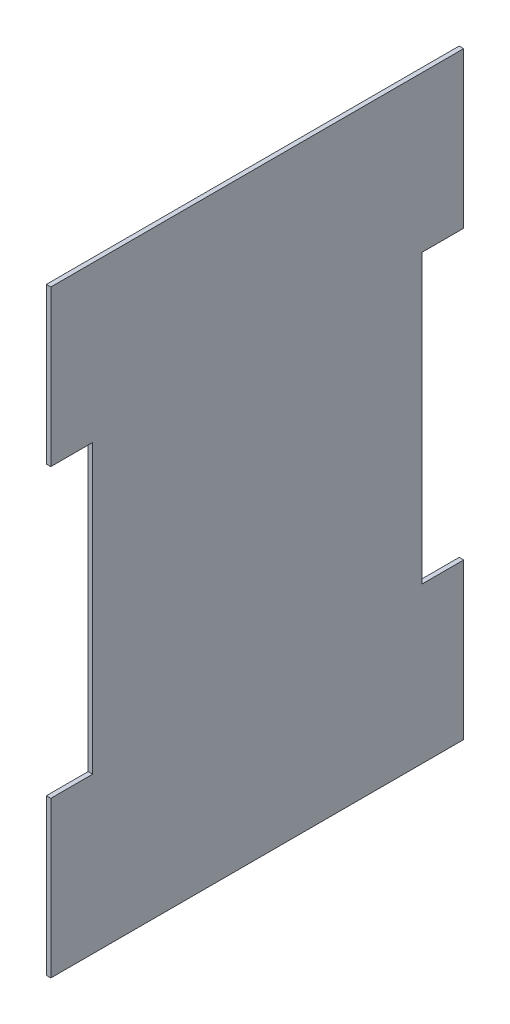
ISO-10303-21;
HEADER;
FILE_DESCRIPTION(('STEP AP214'),'2;1');
FILE_NAME('part.step','',(''),(''),'','','');
FILE_SCHEMA(('AUTOMOTIVE_DESIGN { 1 0 10303 214 1 1 1 1 }'));
ENDSEC;
DATA;
#1=APPLICATION_CONTEXT('core data for automotive mechanical design processes');
#2=APPLICATION_PROTOCOL_DEFINITION('international standard','automotive_design',2000,#1);
#3=PRODUCT_CONTEXT('',#1,'mechanical');
#4=PRODUCT('Part','Part','',(#3));
#5=PRODUCT_RELATED_PRODUCT_CATEGORY('part','',(#4));
#6=PRODUCT_DEFINITION_FORMATION('','',#4);
#7=PRODUCT_DEFINITION_CONTEXT('part definition',#1,'design');
#8=PRODUCT_DEFINITION('design','',#6,#7);
#9=PRODUCT_DEFINITION_SHAPE('','',#8);
#10=(LENGTH_UNIT() NAMED_UNIT(*) SI_UNIT(.MILLI.,.METRE.));
#11=(NAMED_UNIT(*) PLANE_ANGLE_UNIT() SI_UNIT($,.RADIAN.));
#12=(NAMED_UNIT(*) SI_UNIT($,.STERADIAN.) SOLID_ANGLE_UNIT());
#13=UNCERTAINTY_MEASURE_WITH_UNIT(LENGTH_MEASURE(1.E-05),#10,'distance_accuracy_value','');
#14=(GEOMETRIC_REPRESENTATION_CONTEXT(3) GLOBAL_UNCERTAINTY_ASSIGNED_CONTEXT((#13)) GLOBAL_UNIT_ASSIGNED_CONTEXT((#10,
#11,#12)) REPRESENTATION_CONTEXT('',''));
#15=CARTESIAN_POINT('',(0.,0.,0.));
#16=DIRECTION('',(0.,0.,1.));
#17=DIRECTION('',(1.,0.,0.));
#18=AXIS2_PLACEMENT_3D('',#15,#16,#17);
#19=CARTESIAN_POINT('',(3.,190.538461538462,261.692307692308));
#20=DIRECTION('',(0.,0.,-1.));
#21=DIRECTION('',(0.,1.,0.));
#22=AXIS2_PLACEMENT_3D('',#19,#20,#21);
#23=PLANE('',#22);
#24=DIRECTION('',(-1.,0.,0.));
#25=VECTOR('',#24,1.);
#26=CARTESIAN_POINT('',(25.,-105.461538461538,261.692307692308));
#27=LINE('',#26,#25);
#28=CARTESIAN_POINT('',(3.,-105.461538461538,261.692307692308));
#29=VERTEX_POINT('',#28);
#30=CARTESIAN_POINT('',(0.,-105.461538461538,261.692307692308));
#31=VERTEX_POINT('',#30);
#32=EDGE_CURVE('E132',#29,#31,#27,.T.);
#33=ORIENTED_EDGE('',*,*,#32,.T.);
#34=DIRECTION('',(0.,-1.,0.));
#35=VECTOR('',#34,1.);
#36=CARTESIAN_POINT('',(0.,190.538461538462,261.692307692308));
#37=LINE('',#36,#35);
#38=CARTESIAN_POINT('',(0.,-209.461538461539,261.692307692308));
#39=VERTEX_POINT('',#38);
#40=EDGE_CURVE('E147',#31,#39,#37,.T.);
#41=ORIENTED_EDGE('',*,*,#40,.T.);
#42=DIRECTION('',(-1.,0.,0.));
#43=VECTOR('',#42,1.);
#44=CARTESIAN_POINT('',(3.,-209.461538461539,261.692307692308));
#45=LINE('',#44,#43);
#46=CARTESIAN_POINT('',(3.,-209.461538461539,261.692307692308));
#47=VERTEX_POINT('',#46);
#48=EDGE_CURVE('E11',#47,#39,#45,.T.);
#49=ORIENTED_EDGE('',*,*,#48,.F.);
#50=DIRECTION('',(0.,-1.,0.));
#51=VECTOR('',#50,1.);
#52=CARTESIAN_POINT('',(3.,190.538461538462,261.692307692308));
#53=LINE('',#52,#51);
#54=EDGE_CURVE('E149',#29,#47,#53,.T.);
#55=ORIENTED_EDGE('',*,*,#54,.F.);
#56=EDGE_LOOP('',(#33,#41,#49,#55));
#57=FACE_BOUND('',#56,.T.);
#58=ADVANCED_FACE('F39',(#57),#23,.F.);
#59=DIRECTION('',(-1.,0.,0.));
#60=VECTOR('',#59,1.);
#61=CARTESIAN_POINT('',(25.,86.5384615384615,261.692307692308));
#62=LINE('',#61,#60);
#63=CARTESIAN_POINT('',(3.,86.5384615384615,261.692307692308));
#64=VERTEX_POINT('',#63);
#65=CARTESIAN_POINT('',(0.,86.5384615384615,261.692307692308));
#66=VERTEX_POINT('',#65);
#67=EDGE_CURVE('E62',#64,#66,#62,.T.);
#68=ORIENTED_EDGE('',*,*,#67,.F.);
#69=CARTESIAN_POINT('',(3.,190.538461538462,261.692307692308));
#70=VERTEX_POINT('',#69);
#71=EDGE_CURVE('E238',#70,#64,#53,.T.);
#72=ORIENTED_EDGE('',*,*,#71,.F.);
#73=DIRECTION('',(-1.,0.,0.));
#74=VECTOR('',#73,1.);
#75=CARTESIAN_POINT('',(3.,190.538461538462,261.692307692308));
#76=LINE('',#75,#74);
#77=CARTESIAN_POINT('',(0.,190.538461538462,261.692307692308));
#78=VERTEX_POINT('',#77);
#79=EDGE_CURVE('E179',#70,#78,#76,.T.);
#80=ORIENTED_EDGE('',*,*,#79,.T.);
#81=EDGE_CURVE('E157',#78,#66,#37,.T.);
#82=ORIENTED_EDGE('',*,*,#81,.T.);
#83=EDGE_LOOP('',(#68,#72,#80,#82));
#84=FACE_BOUND('',#83,.T.);
#85=ADVANCED_FACE('F263',(#84),#23,.F.);
#86=CARTESIAN_POINT('',(3.,190.538461538462,-14.3076923076922));
#87=DIRECTION('',(0.,0.,1.));
#88=DIRECTION('',(0.,-1.,0.));
#89=AXIS2_PLACEMENT_3D('',#86,#87,#88);
#90=PLANE('',#89);
#91=DIRECTION('',(-1.,0.,0.));
#92=VECTOR('',#91,1.);
#93=CARTESIAN_POINT('',(25.,86.5384615384615,-14.3076923076921));
#94=LINE('',#93,#92);
#95=CARTESIAN_POINT('',(3.,86.5384615384615,-14.3076923076921));
#96=VERTEX_POINT('',#95);
#97=CARTESIAN_POINT('',(0.,86.5384615384615,-14.3076923076921));
#98=VERTEX_POINT('',#97);
#99=EDGE_CURVE('E142',#96,#98,#94,.T.);
#100=ORIENTED_EDGE('',*,*,#99,.T.);
#101=DIRECTION('',(0.,1.,0.));
#102=VECTOR('',#101,1.);
#103=CARTESIAN_POINT('',(0.,190.538461538462,-14.3076923076922));
#104=LINE('',#103,#102);
#105=CARTESIAN_POINT('',(0.,190.538461538462,-14.3076923076922));
#106=VERTEX_POINT('',#105);
#107=EDGE_CURVE('E171',#98,#106,#104,.T.);
#108=ORIENTED_EDGE('',*,*,#107,.T.);
#109=DIRECTION('',(-1.,0.,0.));
#110=VECTOR('',#109,1.);
#111=CARTESIAN_POINT('',(3.,190.538461538462,-14.3076923076922));
#112=LINE('',#111,#110);
#113=CARTESIAN_POINT('',(3.,190.538461538462,-14.3076923076922));
#114=VERTEX_POINT('',#113);
#115=EDGE_CURVE('E183',#114,#106,#112,.T.);
#116=ORIENTED_EDGE('',*,*,#115,.F.);
#117=DIRECTION('',(0.,1.,0.));
#118=VECTOR('',#117,1.);
#119=CARTESIAN_POINT('',(3.,190.538461538462,-14.3076923076922));
#120=LINE('',#119,#118);
#121=EDGE_CURVE('E244',#96,#114,#120,.T.);
#122=ORIENTED_EDGE('',*,*,#121,.F.);
#123=EDGE_LOOP('',(#100,#108,#116,#122));
#124=FACE_BOUND('',#123,.T.);
#125=ADVANCED_FACE('F255',(#124),#90,.F.);
#126=DIRECTION('',(-1.,0.,0.));
#127=VECTOR('',#126,1.);
#128=CARTESIAN_POINT('',(25.,-105.461538461538,-14.3076923076922));
#129=LINE('',#128,#127);
#130=CARTESIAN_POINT('',(3.,-105.461538461538,-14.3076923076922));
#131=VERTEX_POINT('',#130);
#132=CARTESIAN_POINT('',(0.,-105.461538461538,-14.3076923076923));
#133=VERTEX_POINT('',#132);
#134=EDGE_CURVE('E54',#131,#133,#129,.T.);
#135=ORIENTED_EDGE('',*,*,#134,.F.);
#136=CARTESIAN_POINT('',(3.,-209.461538461539,-14.3076923076923));
#137=VERTEX_POINT('',#136);
#138=EDGE_CURVE('E193',#137,#131,#120,.T.);
#139=ORIENTED_EDGE('',*,*,#138,.F.);
#140=DIRECTION('',(-1.,0.,0.));
#141=VECTOR('',#140,1.);
#142=CARTESIAN_POINT('',(3.,-209.461538461539,-14.3076923076923));
#143=LINE('',#142,#141);
#144=CARTESIAN_POINT('',(0.,-209.461538461539,-14.3076923076923));
#145=VERTEX_POINT('',#144);
#146=EDGE_CURVE('E47',#137,#145,#143,.T.);
#147=ORIENTED_EDGE('',*,*,#146,.T.);
#148=EDGE_CURVE('E172',#145,#133,#104,.T.);
#149=ORIENTED_EDGE('',*,*,#148,.T.);
#150=EDGE_LOOP('',(#135,#139,#147,#149));
#151=FACE_BOUND('',#150,.T.);
#152=ADVANCED_FACE('F191',(#151),#90,.F.);
#153=CARTESIAN_POINT('',(3.,0.,0.));
#154=DIRECTION('',(1.,0.,0.));
#155=DIRECTION('',(0.,0.,-1.));
#156=AXIS2_PLACEMENT_3D('',#153,#154,#155);
#157=PLANE('',#156);
#158=DIRECTION('',(0.,-1.,0.));
#159=VECTOR('',#158,1.);
#160=CARTESIAN_POINT('',(3.,0.,233.692307692308));
#161=LINE('',#160,#159);
#162=CARTESIAN_POINT('',(3.,86.5384615384615,233.692307692308));
#163=VERTEX_POINT('',#162);
#164=CARTESIAN_POINT('',(3.,-105.461538461538,233.692307692308));
#165=VERTEX_POINT('',#164);
#166=EDGE_CURVE('E163',#163,#165,#161,.T.);
#167=ORIENTED_EDGE('',*,*,#166,.T.);
#168=DIRECTION('',(0.,0.,1.));
#169=VECTOR('',#168,1.);
#170=CARTESIAN_POINT('',(3.,-105.461538461538,0.));
#171=LINE('',#170,#169);
#172=EDGE_CURVE('E158',#165,#29,#171,.T.);
#173=ORIENTED_EDGE('',*,*,#172,.T.);
#174=ORIENTED_EDGE('',*,*,#54,.T.);
#175=DIRECTION('',(0.,0.,-1.));
#176=VECTOR('',#175,1.);
#177=CARTESIAN_POINT('',(3.,-209.461538461539,261.692307692308));
#178=LINE('',#177,#176);
#179=EDGE_CURVE('E242',#47,#137,#178,.T.);
#180=ORIENTED_EDGE('',*,*,#179,.T.);
#181=ORIENTED_EDGE('',*,*,#138,.T.);
#182=DIRECTION('',(0.,0.,1.));
#183=VECTOR('',#182,1.);
#184=CARTESIAN_POINT('',(3.,-105.461538461538,0.));
#185=LINE('',#184,#183);
#186=CARTESIAN_POINT('',(3.,-105.461538461538,13.6923076923077));
#187=VERTEX_POINT('',#186);
#188=EDGE_CURVE('E151',#131,#187,#185,.T.);
#189=ORIENTED_EDGE('',*,*,#188,.T.);
#190=DIRECTION('',(0.,1.,0.));
#191=VECTOR('',#190,1.);
#192=CARTESIAN_POINT('',(3.,0.,13.6923076923078));
#193=LINE('',#192,#191);
#194=CARTESIAN_POINT('',(3.,86.5384615384615,13.6923076923078));
#195=VERTEX_POINT('',#194);
#196=EDGE_CURVE('E223',#187,#195,#193,.T.);
#197=ORIENTED_EDGE('',*,*,#196,.T.);
#198=DIRECTION('',(0.,0.,-1.));
#199=VECTOR('',#198,1.);
#200=CARTESIAN_POINT('',(3.,86.5384615384615,0.));
#201=LINE('',#200,#199);
#202=EDGE_CURVE('E227',#195,#96,#201,.T.);
#203=ORIENTED_EDGE('',*,*,#202,.T.);
#204=ORIENTED_EDGE('',*,*,#121,.T.);
#205=DIRECTION('',(0.,0.,1.));
#206=VECTOR('',#205,1.);
#207=CARTESIAN_POINT('',(3.,190.538461538462,261.692307692308));
#208=LINE('',#207,#206);
#209=EDGE_CURVE('E167',#114,#70,#208,.T.);
#210=ORIENTED_EDGE('',*,*,#209,.T.);
#211=ORIENTED_EDGE('',*,*,#71,.T.);
#212=DIRECTION('',(0.,0.,-1.));
#213=VECTOR('',#212,1.);
#214=CARTESIAN_POINT('',(3.,86.5384615384615,0.));
#215=LINE('',#214,#213);
#216=EDGE_CURVE('E231',#64,#163,#215,.T.);
#217=ORIENTED_EDGE('',*,*,#216,.T.);
#218=EDGE_LOOP('',(#167,#173,#174,#180,#181,#189,#197,#203,#204,#210,#211,#217));
#219=FACE_BOUND('',#218,.T.);
#220=ADVANCED_FACE('F251',(#219),#157,.T.);
#221=CARTESIAN_POINT('',(0.,0.,0.));
#222=DIRECTION('',(1.,0.,0.));
#223=DIRECTION('',(0.,0.,-1.));
#224=AXIS2_PLACEMENT_3D('',#221,#222,#223);
#225=PLANE('',#224);
#226=DIRECTION('',(0.,0.,-1.));
#227=VECTOR('',#226,1.);
#228=CARTESIAN_POINT('',(0.,-105.461538461538,261.692307692308));
#229=LINE('',#228,#227);
#230=CARTESIAN_POINT('',(0.,-105.461538461538,233.692307692308));
#231=VERTEX_POINT('',#230);
#232=EDGE_CURVE('E129',#31,#231,#229,.T.);
#233=ORIENTED_EDGE('',*,*,#232,.T.);
#234=DIRECTION('',(0.,1.,0.));
#235=VECTOR('',#234,1.);
#236=CARTESIAN_POINT('',(0.,86.5384615384615,233.692307692308));
#237=LINE('',#236,#235);
#238=CARTESIAN_POINT('',(0.,86.5384615384615,233.692307692308));
#239=VERTEX_POINT('',#238);
#240=EDGE_CURVE('E141',#231,#239,#237,.T.);
#241=ORIENTED_EDGE('',*,*,#240,.T.);
#242=DIRECTION('',(0.,0.,1.));
#243=VECTOR('',#242,1.);
#244=CARTESIAN_POINT('',(0.,86.5384615384615,261.692307692308));
#245=LINE('',#244,#243);
#246=EDGE_CURVE('E267',#239,#66,#245,.T.);
#247=ORIENTED_EDGE('',*,*,#246,.T.);
#248=ORIENTED_EDGE('',*,*,#81,.F.);
#249=DIRECTION('',(0.,0.,1.));
#250=VECTOR('',#249,1.);
#251=CARTESIAN_POINT('',(0.,190.538461538462,261.692307692308));
#252=LINE('',#251,#250);
#253=EDGE_CURVE('E176',#106,#78,#252,.T.);
#254=ORIENTED_EDGE('',*,*,#253,.F.);
#255=ORIENTED_EDGE('',*,*,#107,.F.);
#256=DIRECTION('',(0.,0.,1.));
#257=VECTOR('',#256,1.);
#258=CARTESIAN_POINT('',(0.,86.5384615384615,-14.3076923076921));
#259=LINE('',#258,#257);
#260=CARTESIAN_POINT('',(0.,86.5384615384615,13.6923076923078));
#261=VERTEX_POINT('',#260);
#262=EDGE_CURVE('E208',#98,#261,#259,.T.);
#263=ORIENTED_EDGE('',*,*,#262,.T.);
#264=DIRECTION('',(0.,-1.,0.));
#265=VECTOR('',#264,1.);
#266=CARTESIAN_POINT('',(0.,86.5384615384615,13.6923076923078));
#267=LINE('',#266,#265);
#268=CARTESIAN_POINT('',(0.,-105.461538461538,13.6923076923077));
#269=VERTEX_POINT('',#268);
#270=EDGE_CURVE('E200',#261,#269,#267,.T.);
#271=ORIENTED_EDGE('',*,*,#270,.T.);
#272=DIRECTION('',(0.,0.,-1.));
#273=VECTOR('',#272,1.);
#274=CARTESIAN_POINT('',(0.,-105.461538461538,-14.3076923076922));
#275=LINE('',#274,#273);
#276=EDGE_CURVE('E197',#269,#133,#275,.T.);
#277=ORIENTED_EDGE('',*,*,#276,.T.);
#278=ORIENTED_EDGE('',*,*,#148,.F.);
#279=DIRECTION('',(0.,0.,-1.));
#280=VECTOR('',#279,1.);
#281=CARTESIAN_POINT('',(0.,-209.461538461539,261.692307692308));
#282=LINE('',#281,#280);
#283=EDGE_CURVE('E155',#39,#145,#282,.T.);
#284=ORIENTED_EDGE('',*,*,#283,.F.);
#285=ORIENTED_EDGE('',*,*,#40,.F.);
#286=EDGE_LOOP('',(#233,#241,#247,#248,#254,#255,#263,#271,#277,#278,#284,#285));
#287=FACE_BOUND('',#286,.T.);
#288=ADVANCED_FACE('F153',(#287),#225,.F.);
#289=CARTESIAN_POINT('',(3.,-209.461538461539,261.692307692308));
#290=DIRECTION('',(0.,1.,0.));
#291=DIRECTION('',(0.,0.,1.));
#292=AXIS2_PLACEMENT_3D('',#289,#290,#291);
#293=PLANE('',#292);
#294=ORIENTED_EDGE('',*,*,#283,.T.);
#295=ORIENTED_EDGE('',*,*,#146,.F.);
#296=ORIENTED_EDGE('',*,*,#179,.F.);
#297=ORIENTED_EDGE('',*,*,#48,.T.);
#298=EDGE_LOOP('',(#294,#295,#296,#297));
#299=FACE_BOUND('',#298,.T.);
#300=ADVANCED_FACE('F305',(#299),#293,.F.);
#301=CARTESIAN_POINT('',(3.,190.538461538462,261.692307692308));
#302=DIRECTION('',(0.,-1.,0.));
#303=DIRECTION('',(0.,0.,-1.));
#304=AXIS2_PLACEMENT_3D('',#301,#302,#303);
#305=PLANE('',#304);
#306=ORIENTED_EDGE('',*,*,#253,.T.);
#307=ORIENTED_EDGE('',*,*,#79,.F.);
#308=ORIENTED_EDGE('',*,*,#209,.F.);
#309=ORIENTED_EDGE('',*,*,#115,.T.);
#310=EDGE_LOOP('',(#306,#307,#308,#309));
#311=FACE_BOUND('',#310,.T.);
#312=ADVANCED_FACE('F259',(#311),#305,.F.);
#313=CARTESIAN_POINT('',(25.,86.5384615384615,-14.3076923076921));
#314=DIRECTION('',(0.,-1.,0.));
#315=DIRECTION('',(0.,0.,-1.));
#316=AXIS2_PLACEMENT_3D('',#313,#314,#315);
#317=PLANE('',#316);
#318=DIRECTION('',(-1.,0.,0.));
#319=VECTOR('',#318,1.);
#320=CARTESIAN_POINT('',(25.,86.5384615384615,13.6923076923078));
#321=LINE('',#320,#319);
#322=EDGE_CURVE('E214',#195,#261,#321,.T.);
#323=ORIENTED_EDGE('',*,*,#322,.T.);
#324=ORIENTED_EDGE('',*,*,#262,.F.);
#325=ORIENTED_EDGE('',*,*,#99,.F.);
#326=ORIENTED_EDGE('',*,*,#202,.F.);
#327=EDGE_LOOP('',(#323,#324,#325,#326));
#328=FACE_BOUND('',#327,.T.);
#329=ADVANCED_FACE('F278',(#328),#317,.T.);
#330=CARTESIAN_POINT('',(25.,86.5384615384615,13.6923076923078));
#331=DIRECTION('',(0.,0.,-1.));
#332=DIRECTION('',(0.,1.,0.));
#333=AXIS2_PLACEMENT_3D('',#330,#331,#332);
#334=PLANE('',#333);
#335=DIRECTION('',(-1.,0.,0.));
#336=VECTOR('',#335,1.);
#337=CARTESIAN_POINT('',(25.,-105.461538461538,13.6923076923077));
#338=LINE('',#337,#336);
#339=EDGE_CURVE('E206',#187,#269,#338,.T.);
#340=ORIENTED_EDGE('',*,*,#339,.T.);
#341=ORIENTED_EDGE('',*,*,#270,.F.);
#342=ORIENTED_EDGE('',*,*,#322,.F.);
#343=ORIENTED_EDGE('',*,*,#196,.F.);
#344=EDGE_LOOP('',(#340,#341,#342,#343));
#345=FACE_BOUND('',#344,.T.);
#346=ADVANCED_FACE('F281',(#345),#334,.T.);
#347=CARTESIAN_POINT('',(25.,-105.461538461538,-14.3076923076922));
#348=DIRECTION('',(0.,1.,0.));
#349=DIRECTION('',(0.,0.,1.));
#350=AXIS2_PLACEMENT_3D('',#347,#348,#349);
#351=PLANE('',#350);
#352=ORIENTED_EDGE('',*,*,#134,.T.);
#353=ORIENTED_EDGE('',*,*,#276,.F.);
#354=ORIENTED_EDGE('',*,*,#339,.F.);
#355=ORIENTED_EDGE('',*,*,#188,.F.);
#356=EDGE_LOOP('',(#352,#353,#354,#355));
#357=FACE_BOUND('',#356,.T.);
#358=ADVANCED_FACE('F282',(#357),#351,.T.);
#359=CARTESIAN_POINT('',(25.,-105.461538461538,261.692307692308));
#360=DIRECTION('',(0.,1.,0.));
#361=DIRECTION('',(0.,0.,1.));
#362=AXIS2_PLACEMENT_3D('',#359,#360,#361);
#363=PLANE('',#362);
#364=DIRECTION('',(-1.,0.,0.));
#365=VECTOR('',#364,1.);
#366=CARTESIAN_POINT('',(25.,-105.461538461538,233.692307692308));
#367=LINE('',#366,#365);
#368=EDGE_CURVE('E135',#165,#231,#367,.T.);
#369=ORIENTED_EDGE('',*,*,#368,.T.);
#370=ORIENTED_EDGE('',*,*,#232,.F.);
#371=ORIENTED_EDGE('',*,*,#32,.F.);
#372=ORIENTED_EDGE('',*,*,#172,.F.);
#373=EDGE_LOOP('',(#369,#370,#371,#372));
#374=FACE_BOUND('',#373,.T.);
#375=ADVANCED_FACE('F131',(#374),#363,.T.);
#376=CARTESIAN_POINT('',(25.,86.5384615384615,233.692307692308));
#377=DIRECTION('',(0.,0.,1.));
#378=DIRECTION('',(1.,0.,0.));
#379=AXIS2_PLACEMENT_3D('',#376,#377,#378);
#380=PLANE('',#379);
#381=DIRECTION('',(-1.,0.,0.));
#382=VECTOR('',#381,1.);
#383=CARTESIAN_POINT('',(25.,86.5384615384615,233.692307692308));
#384=LINE('',#383,#382);
#385=EDGE_CURVE('E266',#163,#239,#384,.T.);
#386=ORIENTED_EDGE('',*,*,#385,.T.);
#387=ORIENTED_EDGE('',*,*,#240,.F.);
#388=ORIENTED_EDGE('',*,*,#368,.F.);
#389=ORIENTED_EDGE('',*,*,#166,.F.);
#390=EDGE_LOOP('',(#386,#387,#388,#389));
#391=FACE_BOUND('',#390,.T.);
#392=ADVANCED_FACE('F289',(#391),#380,.T.);
#393=CARTESIAN_POINT('',(25.,86.5384615384615,261.692307692308));
#394=DIRECTION('',(0.,-1.,0.));
#395=DIRECTION('',(0.,0.,-1.));
#396=AXIS2_PLACEMENT_3D('',#393,#394,#395);
#397=PLANE('',#396);
#398=ORIENTED_EDGE('',*,*,#67,.T.);
#399=ORIENTED_EDGE('',*,*,#246,.F.);
#400=ORIENTED_EDGE('',*,*,#385,.F.);
#401=ORIENTED_EDGE('',*,*,#216,.F.);
#402=EDGE_LOOP('',(#398,#399,#400,#401));
#403=FACE_BOUND('',#402,.T.);
#404=ADVANCED_FACE('F265',(#403),#397,.T.);
#405=CLOSED_SHELL('',(#58,#85,#125,#152,#220,#288,#300,#312,#329,#346,#358,#375,#392,#404));
#406=MANIFOLD_SOLID_BREP('B2',#405);
#407=ADVANCED_BREP_SHAPE_REPRESENTATION('',(#18,#406),#14);
#408=SHAPE_DEFINITION_REPRESENTATION(#9,#407);
ENDSEC;
END-ISO-10303-21;
